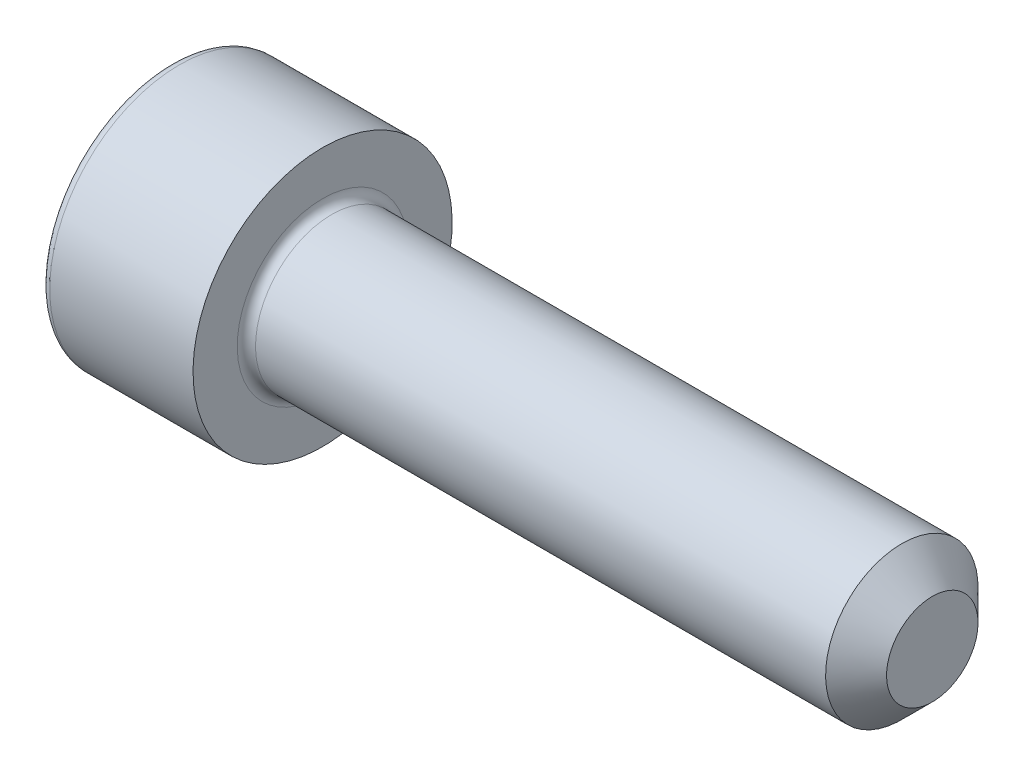
ISO-10303-21;
HEADER;
FILE_DESCRIPTION(('STEP AP214'),'2;1');
FILE_NAME('part.step','',(''),(''),'','','');
FILE_SCHEMA(('AUTOMOTIVE_DESIGN { 1 0 10303 214 1 1 1 1 }'));
ENDSEC;
DATA;
#1=APPLICATION_CONTEXT('core data for automotive mechanical design processes');
#2=APPLICATION_PROTOCOL_DEFINITION('international standard','automotive_design',2000,#1);
#3=PRODUCT_CONTEXT('',#1,'mechanical');
#4=PRODUCT('Part','Part','',(#3));
#5=PRODUCT_RELATED_PRODUCT_CATEGORY('part','',(#4));
#6=PRODUCT_DEFINITION_FORMATION('','',#4);
#7=PRODUCT_DEFINITION_CONTEXT('part definition',#1,'design');
#8=PRODUCT_DEFINITION('design','',#6,#7);
#9=PRODUCT_DEFINITION_SHAPE('','',#8);
#10=(LENGTH_UNIT() NAMED_UNIT(*) SI_UNIT(.MILLI.,.METRE.));
#11=(NAMED_UNIT(*) PLANE_ANGLE_UNIT() SI_UNIT($,.RADIAN.));
#12=(NAMED_UNIT(*) SI_UNIT($,.STERADIAN.) SOLID_ANGLE_UNIT());
#13=UNCERTAINTY_MEASURE_WITH_UNIT(LENGTH_MEASURE(1.E-05),#10,'distance_accuracy_value','');
#14=(GEOMETRIC_REPRESENTATION_CONTEXT(3) GLOBAL_UNCERTAINTY_ASSIGNED_CONTEXT((#13)) GLOBAL_UNIT_ASSIGNED_CONTEXT((#10,
#11,#12)) REPRESENTATION_CONTEXT('',''));
#15=CARTESIAN_POINT('',(0.,0.,0.));
#16=DIRECTION('',(0.,0.,1.));
#17=DIRECTION('',(1.,0.,0.));
#18=AXIS2_PLACEMENT_3D('',#15,#16,#17);
#19=CARTESIAN_POINT('',(0.,0.,0.));
#20=DIRECTION('',(-1.,0.,0.));
#21=DIRECTION('',(0.,-1.,0.));
#22=AXIS2_PLACEMENT_3D('',#19,#20,#21);
#23=PLANE('',#22);
#24=CARTESIAN_POINT('',(0.,0.,0.));
#25=DIRECTION('',(-1.,0.,0.));
#26=DIRECTION('',(0.,-1.,0.));
#27=AXIS2_PLACEMENT_3D('',#24,#25,#26);
#28=CIRCLE('',#27,3.95);
#29=CARTESIAN_POINT('',(0.,-3.95,0.));
#30=VERTEX_POINT('',#29);
#31=EDGE_CURVE('E158',#30,#30,#28,.T.);
#32=ORIENTED_EDGE('',*,*,#31,.T.);
#33=EDGE_LOOP('',(#32));
#34=FACE_BOUND('',#33,.T.);
#35=DIRECTION('',(0.,0.,-1.));
#36=VECTOR('',#35,1.);
#37=CARTESIAN_POINT('',(0.,2.,1.15470053837925));
#38=LINE('',#37,#36);
#39=CARTESIAN_POINT('',(0.,2.,1.15470053837925));
#40=VERTEX_POINT('',#39);
#41=CARTESIAN_POINT('',(0.,2.,-1.15470053837925));
#42=VERTEX_POINT('',#41);
#43=EDGE_CURVE('E54',#40,#42,#38,.T.);
#44=ORIENTED_EDGE('',*,*,#43,.F.);
#45=DIRECTION('',(0.,0.866025403784439,-0.5));
#46=VECTOR('',#45,1.);
#47=CARTESIAN_POINT('',(0.,0.,2.3094010767585));
#48=LINE('',#47,#46);
#49=CARTESIAN_POINT('',(0.,0.,2.3094010767585));
#50=VERTEX_POINT('',#49);
#51=EDGE_CURVE('E137',#50,#40,#48,.T.);
#52=ORIENTED_EDGE('',*,*,#51,.F.);
#53=DIRECTION('',(0.,0.866025403784438,0.5));
#54=VECTOR('',#53,1.);
#55=CARTESIAN_POINT('',(0.,-2.,1.15470053837925));
#56=LINE('',#55,#54);
#57=CARTESIAN_POINT('',(0.,-2.,1.15470053837925));
#58=VERTEX_POINT('',#57);
#59=EDGE_CURVE('E135',#58,#50,#56,.T.);
#60=ORIENTED_EDGE('',*,*,#59,.F.);
#61=DIRECTION('',(0.,0.,1.));
#62=VECTOR('',#61,1.);
#63=CARTESIAN_POINT('',(0.,-2.,-1.15470053837925));
#64=LINE('',#63,#62);
#65=CARTESIAN_POINT('',(0.,-2.,-1.15470053837925));
#66=VERTEX_POINT('',#65);
#67=EDGE_CURVE('E102',#66,#58,#64,.T.);
#68=ORIENTED_EDGE('',*,*,#67,.F.);
#69=DIRECTION('',(0.,-0.866025403784439,0.5));
#70=VECTOR('',#69,1.);
#71=CARTESIAN_POINT('',(0.,0.,-2.3094010767585));
#72=LINE('',#71,#70);
#73=CARTESIAN_POINT('',(0.,0.,-2.3094010767585));
#74=VERTEX_POINT('',#73);
#75=EDGE_CURVE('E131',#74,#66,#72,.T.);
#76=ORIENTED_EDGE('',*,*,#75,.F.);
#77=DIRECTION('',(0.,-0.866025403784439,-0.5));
#78=VECTOR('',#77,1.);
#79=CARTESIAN_POINT('',(0.,2.,-1.15470053837925));
#80=LINE('',#79,#78);
#81=EDGE_CURVE('E128',#42,#74,#80,.T.);
#82=ORIENTED_EDGE('',*,*,#81,.F.);
#83=EDGE_LOOP('',(#44,#52,#60,#68,#76,#82));
#84=FACE_BOUND('',#83,.T.);
#85=ADVANCED_FACE('F38',(#34,#84),#23,.T.);
#86=CARTESIAN_POINT('',(25.,0.,0.));
#87=DIRECTION('',(1.,0.,0.));
#88=DIRECTION('',(0.,1.,0.));
#89=AXIS2_PLACEMENT_3D('',#86,#87,#88);
#90=CYLINDRICAL_SURFACE('',#89,4.25);
#91=CARTESIAN_POINT('',(0.300000000000002,0.,0.));
#92=DIRECTION('',(-1.,0.,0.));
#93=DIRECTION('',(0.,-1.,0.));
#94=AXIS2_PLACEMENT_3D('',#91,#92,#93);
#95=CIRCLE('',#94,4.25);
#96=CARTESIAN_POINT('',(0.300000000000002,-4.25,0.));
#97=VERTEX_POINT('',#96);
#98=EDGE_CURVE('E155',#97,#97,#95,.F.);
#99=ORIENTED_EDGE('',*,*,#98,.T.);
#100=EDGE_LOOP('',(#99));
#101=FACE_BOUND('',#100,.T.);
#102=CARTESIAN_POINT('',(5.,0.,0.));
#103=DIRECTION('',(1.,0.,0.));
#104=DIRECTION('',(0.,1.,0.));
#105=AXIS2_PLACEMENT_3D('',#102,#103,#104);
#106=CIRCLE('',#105,4.25);
#107=CARTESIAN_POINT('',(5.,4.25,0.));
#108=VERTEX_POINT('',#107);
#109=EDGE_CURVE('E141',#108,#108,#106,.T.);
#110=ORIENTED_EDGE('',*,*,#109,.F.);
#111=EDGE_LOOP('',(#110));
#112=FACE_BOUND('',#111,.T.);
#113=ADVANCED_FACE('F175',(#101,#112),#90,.T.);
#114=CARTESIAN_POINT('',(5.,4.25,0.));
#115=DIRECTION('',(1.,0.,0.));
#116=DIRECTION('',(0.,1.,0.));
#117=AXIS2_PLACEMENT_3D('',#114,#115,#116);
#118=PLANE('',#117);
#119=CARTESIAN_POINT('',(5.,0.,0.));
#120=DIRECTION('',(1.,0.,0.));
#121=DIRECTION('',(0.,1.,0.));
#122=AXIS2_PLACEMENT_3D('',#119,#120,#121);
#123=CIRCLE('',#122,2.8);
#124=CARTESIAN_POINT('',(5.,2.8,0.));
#125=VERTEX_POINT('',#124);
#126=EDGE_CURVE('E152',#125,#125,#123,.F.);
#127=ORIENTED_EDGE('',*,*,#126,.T.);
#128=EDGE_LOOP('',(#127));
#129=FACE_BOUND('',#128,.T.);
#130=ORIENTED_EDGE('',*,*,#109,.T.);
#131=EDGE_LOOP('',(#130));
#132=FACE_BOUND('',#131,.T.);
#133=ADVANCED_FACE('F181',(#129,#132),#118,.T.);
#134=CARTESIAN_POINT('',(25.,0.,0.));
#135=DIRECTION('',(1.,0.,0.));
#136=DIRECTION('',(0.,1.,0.));
#137=AXIS2_PLACEMENT_3D('',#134,#135,#136);
#138=CYLINDRICAL_SURFACE('',#137,2.5);
#139=CARTESIAN_POINT('',(24.,0.,0.));
#140=DIRECTION('',(1.,0.,0.));
#141=DIRECTION('',(0.,1.,0.));
#142=AXIS2_PLACEMENT_3D('',#139,#140,#141);
#143=CIRCLE('',#142,2.5);
#144=CARTESIAN_POINT('',(24.,2.5,0.));
#145=VERTEX_POINT('',#144);
#146=EDGE_CURVE('E11',#145,#145,#143,.F.);
#147=ORIENTED_EDGE('',*,*,#146,.T.);
#148=EDGE_LOOP('',(#147));
#149=FACE_BOUND('',#148,.T.);
#150=CARTESIAN_POINT('',(5.3,0.,0.));
#151=DIRECTION('',(1.,0.,0.));
#152=DIRECTION('',(0.,1.,0.));
#153=AXIS2_PLACEMENT_3D('',#150,#151,#152);
#154=CIRCLE('',#153,2.5);
#155=CARTESIAN_POINT('',(5.3,2.5,0.));
#156=VERTEX_POINT('',#155);
#157=EDGE_CURVE('E149',#156,#156,#154,.T.);
#158=ORIENTED_EDGE('',*,*,#157,.T.);
#159=EDGE_LOOP('',(#158));
#160=FACE_BOUND('',#159,.T.);
#161=ADVANCED_FACE('F198',(#149,#160),#138,.T.);
#162=CARTESIAN_POINT('',(25.,2.5,0.));
#163=DIRECTION('',(1.,0.,0.));
#164=DIRECTION('',(0.,1.,0.));
#165=AXIS2_PLACEMENT_3D('',#162,#163,#164);
#166=PLANE('',#165);
#167=CARTESIAN_POINT('',(25.,0.,0.));
#168=DIRECTION('',(1.,0.,0.));
#169=DIRECTION('',(0.,1.,0.));
#170=AXIS2_PLACEMENT_3D('',#167,#168,#169);
#171=CIRCLE('',#170,1.5);
#172=CARTESIAN_POINT('',(25.,1.5,0.));
#173=VERTEX_POINT('',#172);
#174=EDGE_CURVE('E47',#173,#173,#171,.T.);
#175=ORIENTED_EDGE('',*,*,#174,.T.);
#176=EDGE_LOOP('',(#175));
#177=FACE_BOUND('',#176,.T.);
#178=ADVANCED_FACE('F163',(#177),#166,.T.);
#179=CARTESIAN_POINT('',(2.5,2.,1.15470053837925));
#180=DIRECTION('',(0.,1.,0.));
#181=DIRECTION('',(-1.,0.,0.));
#182=AXIS2_PLACEMENT_3D('',#179,#180,#181);
#183=PLANE('',#182);
#184=ORIENTED_EDGE('',*,*,#43,.T.);
#185=DIRECTION('',(-1.,0.,0.));
#186=VECTOR('',#185,1.);
#187=CARTESIAN_POINT('',(2.5,2.,-1.15470053837925));
#188=LINE('',#187,#186);
#189=CARTESIAN_POINT('',(2.5,2.,-1.15470053837925));
#190=VERTEX_POINT('',#189);
#191=EDGE_CURVE('E84',#190,#42,#188,.T.);
#192=ORIENTED_EDGE('',*,*,#191,.F.);
#193=DIRECTION('',(0.,0.,-1.));
#194=VECTOR('',#193,1.);
#195=CARTESIAN_POINT('',(2.5,2.,1.15470053837925));
#196=LINE('',#195,#194);
#197=CARTESIAN_POINT('',(2.5,2.,1.15470053837925));
#198=VERTEX_POINT('',#197);
#199=EDGE_CURVE('E139',#198,#190,#196,.T.);
#200=ORIENTED_EDGE('',*,*,#199,.F.);
#201=DIRECTION('',(-1.,0.,0.));
#202=VECTOR('',#201,1.);
#203=CARTESIAN_POINT('',(2.5,2.,1.15470053837925));
#204=LINE('',#203,#202);
#205=EDGE_CURVE('E62',#198,#40,#204,.T.);
#206=ORIENTED_EDGE('',*,*,#205,.T.);
#207=EDGE_LOOP('',(#184,#192,#200,#206));
#208=FACE_BOUND('',#207,.T.);
#209=ADVANCED_FACE('F206',(#208),#183,.F.);
#210=CARTESIAN_POINT('',(2.5,0.,2.3094010767585));
#211=DIRECTION('',(0.,0.5,0.866025403784439));
#212=DIRECTION('',(0.,-0.866025403784439,0.5));
#213=AXIS2_PLACEMENT_3D('',#210,#211,#212);
#214=PLANE('',#213);
#215=ORIENTED_EDGE('',*,*,#51,.T.);
#216=ORIENTED_EDGE('',*,*,#205,.F.);
#217=DIRECTION('',(0.,0.866025403784439,-0.5));
#218=VECTOR('',#217,1.);
#219=CARTESIAN_POINT('',(2.5,0.,2.3094010767585));
#220=LINE('',#219,#218);
#221=CARTESIAN_POINT('',(2.5,0.,2.3094010767585));
#222=VERTEX_POINT('',#221);
#223=EDGE_CURVE('E114',#222,#198,#220,.T.);
#224=ORIENTED_EDGE('',*,*,#223,.F.);
#225=DIRECTION('',(-1.,0.,0.));
#226=VECTOR('',#225,1.);
#227=CARTESIAN_POINT('',(2.5,0.,2.3094010767585));
#228=LINE('',#227,#226);
#229=EDGE_CURVE('E106',#222,#50,#228,.T.);
#230=ORIENTED_EDGE('',*,*,#229,.T.);
#231=EDGE_LOOP('',(#215,#216,#224,#230));
#232=FACE_BOUND('',#231,.T.);
#233=ADVANCED_FACE('F212',(#232),#214,.F.);
#234=CARTESIAN_POINT('',(2.5,-2.,1.15470053837925));
#235=DIRECTION('',(0.,-0.5,0.866025403784438));
#236=DIRECTION('',(0.,-0.866025403784439,-0.5));
#237=AXIS2_PLACEMENT_3D('',#234,#235,#236);
#238=PLANE('',#237);
#239=ORIENTED_EDGE('',*,*,#59,.T.);
#240=ORIENTED_EDGE('',*,*,#229,.F.);
#241=DIRECTION('',(0.,0.866025403784438,0.5));
#242=VECTOR('',#241,1.);
#243=CARTESIAN_POINT('',(2.5,-2.,1.15470053837925));
#244=LINE('',#243,#242);
#245=CARTESIAN_POINT('',(2.5,-2.,1.15470053837925));
#246=VERTEX_POINT('',#245);
#247=EDGE_CURVE('E110',#246,#222,#244,.T.);
#248=ORIENTED_EDGE('',*,*,#247,.F.);
#249=DIRECTION('',(-1.,0.,0.));
#250=VECTOR('',#249,1.);
#251=CARTESIAN_POINT('',(2.5,-2.,1.15470053837925));
#252=LINE('',#251,#250);
#253=EDGE_CURVE('E95',#246,#58,#252,.T.);
#254=ORIENTED_EDGE('',*,*,#253,.T.);
#255=EDGE_LOOP('',(#239,#240,#248,#254));
#256=FACE_BOUND('',#255,.T.);
#257=ADVANCED_FACE('F111',(#256),#238,.F.);
#258=CARTESIAN_POINT('',(2.5,-2.,-1.15470053837925));
#259=DIRECTION('',(0.,-1.,0.));
#260=DIRECTION('',(0.,0.,-1.));
#261=AXIS2_PLACEMENT_3D('',#258,#259,#260);
#262=PLANE('',#261);
#263=ORIENTED_EDGE('',*,*,#67,.T.);
#264=ORIENTED_EDGE('',*,*,#253,.F.);
#265=DIRECTION('',(0.,0.,1.));
#266=VECTOR('',#265,1.);
#267=CARTESIAN_POINT('',(2.5,-2.,-1.15470053837925));
#268=LINE('',#267,#266);
#269=CARTESIAN_POINT('',(2.5,-2.,-1.15470053837925));
#270=VERTEX_POINT('',#269);
#271=EDGE_CURVE('E99',#270,#246,#268,.T.);
#272=ORIENTED_EDGE('',*,*,#271,.F.);
#273=DIRECTION('',(-1.,0.,0.));
#274=VECTOR('',#273,1.);
#275=CARTESIAN_POINT('',(2.5,-2.,-1.15470053837925));
#276=LINE('',#275,#274);
#277=EDGE_CURVE('E107',#270,#66,#276,.T.);
#278=ORIENTED_EDGE('',*,*,#277,.T.);
#279=EDGE_LOOP('',(#263,#264,#272,#278));
#280=FACE_BOUND('',#279,.T.);
#281=ADVANCED_FACE('F97',(#280),#262,.F.);
#282=CARTESIAN_POINT('',(2.5,0.,-2.3094010767585));
#283=DIRECTION('',(0.,-0.5,-0.866025403784439));
#284=DIRECTION('',(0.,0.866025403784439,-0.5));
#285=AXIS2_PLACEMENT_3D('',#282,#283,#284);
#286=PLANE('',#285);
#287=ORIENTED_EDGE('',*,*,#75,.T.);
#288=ORIENTED_EDGE('',*,*,#277,.F.);
#289=DIRECTION('',(0.,-0.866025403784439,0.5));
#290=VECTOR('',#289,1.);
#291=CARTESIAN_POINT('',(2.5,0.,-2.3094010767585));
#292=LINE('',#291,#290);
#293=CARTESIAN_POINT('',(2.5,0.,-2.3094010767585));
#294=VERTEX_POINT('',#293);
#295=EDGE_CURVE('E120',#294,#270,#292,.T.);
#296=ORIENTED_EDGE('',*,*,#295,.F.);
#297=DIRECTION('',(-1.,0.,0.));
#298=VECTOR('',#297,1.);
#299=CARTESIAN_POINT('',(2.5,0.,-2.3094010767585));
#300=LINE('',#299,#298);
#301=EDGE_CURVE('E144',#294,#74,#300,.T.);
#302=ORIENTED_EDGE('',*,*,#301,.T.);
#303=EDGE_LOOP('',(#287,#288,#296,#302));
#304=FACE_BOUND('',#303,.T.);
#305=ADVANCED_FACE('F215',(#304),#286,.F.);
#306=CARTESIAN_POINT('',(2.5,2.,-1.15470053837925));
#307=DIRECTION('',(0.,0.5,-0.866025403784439));
#308=DIRECTION('',(0.,0.866025403784439,0.5));
#309=AXIS2_PLACEMENT_3D('',#306,#307,#308);
#310=PLANE('',#309);
#311=ORIENTED_EDGE('',*,*,#81,.T.);
#312=ORIENTED_EDGE('',*,*,#301,.F.);
#313=DIRECTION('',(0.,-0.866025403784439,-0.5));
#314=VECTOR('',#313,1.);
#315=CARTESIAN_POINT('',(2.5,2.,-1.15470053837925));
#316=LINE('',#315,#314);
#317=EDGE_CURVE('E122',#190,#294,#316,.T.);
#318=ORIENTED_EDGE('',*,*,#317,.F.);
#319=ORIENTED_EDGE('',*,*,#191,.T.);
#320=EDGE_LOOP('',(#311,#312,#318,#319));
#321=FACE_BOUND('',#320,.T.);
#322=ADVANCED_FACE('F192',(#321),#310,.F.);
#323=CARTESIAN_POINT('',(2.5,0.,0.));
#324=DIRECTION('',(-1.,0.,0.));
#325=DIRECTION('',(0.,-1.,0.));
#326=AXIS2_PLACEMENT_3D('',#323,#324,#325);
#327=PLANE('',#326);
#328=ORIENTED_EDGE('',*,*,#199,.T.);
#329=ORIENTED_EDGE('',*,*,#317,.T.);
#330=ORIENTED_EDGE('',*,*,#295,.T.);
#331=ORIENTED_EDGE('',*,*,#271,.T.);
#332=ORIENTED_EDGE('',*,*,#247,.T.);
#333=ORIENTED_EDGE('',*,*,#223,.T.);
#334=EDGE_LOOP('',(#328,#329,#330,#331,#332,#333));
#335=FACE_BOUND('',#334,.T.);
#336=ADVANCED_FACE('F117',(#335),#327,.T.);
#337=CARTESIAN_POINT('',(5.3,0.,0.));
#338=DIRECTION('',(1.,0.,0.));
#339=DIRECTION('',(0.,1.,0.));
#340=AXIS2_PLACEMENT_3D('',#337,#338,#339);
#341=TOROIDAL_SURFACE('',#340,2.8,0.3);
#342=ORIENTED_EDGE('',*,*,#126,.F.);
#343=EDGE_LOOP('',(#342));
#344=FACE_BOUND('',#343,.T.);
#345=ORIENTED_EDGE('',*,*,#157,.F.);
#346=EDGE_LOOP('',(#345));
#347=FACE_BOUND('',#346,.T.);
#348=ADVANCED_FACE('F171',(#344,#347),#341,.F.);
#349=CARTESIAN_POINT('',(0.300000000000002,0.,0.));
#350=DIRECTION('',(-1.,0.,0.));
#351=DIRECTION('',(0.,-1.,0.));
#352=AXIS2_PLACEMENT_3D('',#349,#350,#351);
#353=TOROIDAL_SURFACE('',#352,3.95,0.3);
#354=ORIENTED_EDGE('',*,*,#31,.F.);
#355=EDGE_LOOP('',(#354));
#356=FACE_BOUND('',#355,.T.);
#357=ORIENTED_EDGE('',*,*,#98,.F.);
#358=EDGE_LOOP('',(#357));
#359=FACE_BOUND('',#358,.T.);
#360=ADVANCED_FACE('F166',(#356,#359),#353,.T.);
#361=CARTESIAN_POINT('',(25.,0.,0.));
#362=DIRECTION('',(-1.,0.,0.));
#363=DIRECTION('',(0.,-1.,0.));
#364=AXIS2_PLACEMENT_3D('',#361,#362,#363);
#365=CONICAL_SURFACE('',#364,1.5,0.785398163397447);
#366=ORIENTED_EDGE('',*,*,#146,.F.);
#367=EDGE_LOOP('',(#366));
#368=FACE_BOUND('',#367,.T.);
#369=ORIENTED_EDGE('',*,*,#174,.F.);
#370=EDGE_LOOP('',(#369));
#371=FACE_BOUND('',#370,.T.);
#372=ADVANCED_FACE('F41',(#368,#371),#365,.T.);
#373=CLOSED_SHELL('',(#85,#113,#133,#161,#178,#209,#233,#257,#281,#305,#322,#336,#348,#360,#372));
#374=MANIFOLD_SOLID_BREP('B2',#373);
#375=ADVANCED_BREP_SHAPE_REPRESENTATION('',(#18,#374),#14);
#376=SHAPE_DEFINITION_REPRESENTATION(#9,#375);
ENDSEC;
END-ISO-10303-21;
